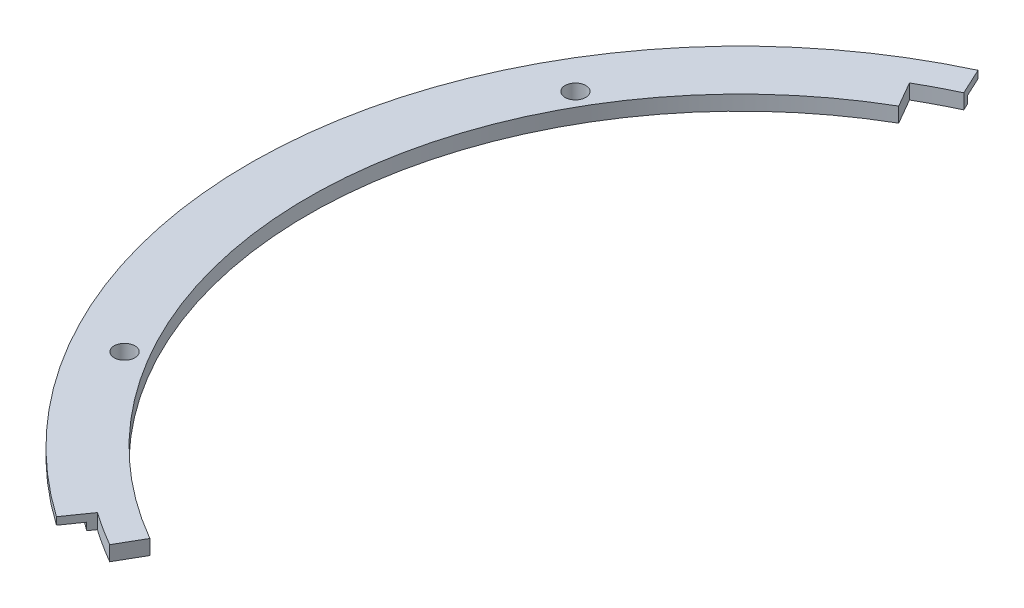
ISO-10303-21;
HEADER;
FILE_DESCRIPTION(('STEP AP214'),'2;1');
FILE_NAME('part.step','',(''),(''),'','','');
FILE_SCHEMA(('AUTOMOTIVE_DESIGN { 1 0 10303 214 1 1 1 1 }'));
ENDSEC;
DATA;
#1=APPLICATION_CONTEXT('core data for automotive mechanical design processes');
#2=APPLICATION_PROTOCOL_DEFINITION('international standard','automotive_design',2000,#1);
#3=PRODUCT_CONTEXT('',#1,'mechanical');
#4=PRODUCT('Part','Part','',(#3));
#5=PRODUCT_RELATED_PRODUCT_CATEGORY('part','',(#4));
#6=PRODUCT_DEFINITION_FORMATION('','',#4);
#7=PRODUCT_DEFINITION_CONTEXT('part definition',#1,'design');
#8=PRODUCT_DEFINITION('design','',#6,#7);
#9=PRODUCT_DEFINITION_SHAPE('','',#8);
#10=(LENGTH_UNIT() NAMED_UNIT(*) SI_UNIT(.MILLI.,.METRE.));
#11=(NAMED_UNIT(*) PLANE_ANGLE_UNIT() SI_UNIT($,.RADIAN.));
#12=(NAMED_UNIT(*) SI_UNIT($,.STERADIAN.) SOLID_ANGLE_UNIT());
#13=UNCERTAINTY_MEASURE_WITH_UNIT(LENGTH_MEASURE(1.E-05),#10,'distance_accuracy_value','');
#14=(GEOMETRIC_REPRESENTATION_CONTEXT(3) GLOBAL_UNCERTAINTY_ASSIGNED_CONTEXT((#13)) GLOBAL_UNIT_ASSIGNED_CONTEXT((#10,
#11,#12)) REPRESENTATION_CONTEXT('',''));
#15=CARTESIAN_POINT('',(0.,0.,0.));
#16=DIRECTION('',(0.,0.,1.));
#17=DIRECTION('',(1.,0.,0.));
#18=AXIS2_PLACEMENT_3D('',#15,#16,#17);
#19=CARTESIAN_POINT('',(0.,5.08,0.));
#20=DIRECTION('',(0.,-1.,0.));
#21=DIRECTION('',(0.,0.,-1.));
#22=AXIS2_PLACEMENT_3D('',#19,#20,#21);
#23=CYLINDRICAL_SURFACE('',#22,160.85);
#24=CARTESIAN_POINT('',(0.,0.,0.));
#25=DIRECTION('',(0.,1.,0.));
#26=DIRECTION('',(0.,0.,1.));
#27=AXIS2_PLACEMENT_3D('',#24,#25,#26);
#28=CIRCLE('',#27,160.85);
#29=CARTESIAN_POINT('',(-67.9781474009922,0.,-145.779607544845));
#30=VERTEX_POINT('',#29);
#31=CARTESIAN_POINT('',(-92.2597697870664,0.,131.760606323884));
#32=VERTEX_POINT('',#31);
#33=EDGE_CURVE('E144',#30,#32,#28,.T.);
#34=ORIENTED_EDGE('',*,*,#33,.T.);
#35=DIRECTION('',(0.,-1.,0.));
#36=VECTOR('',#35,1.);
#37=CARTESIAN_POINT('',(-92.2597697870664,5.08,131.760606323884));
#38=LINE('',#37,#36);
#39=CARTESIAN_POINT('',(-92.2597697870664,2.54,131.760606323884));
#40=VERTEX_POINT('',#39);
#41=EDGE_CURVE('E178',#32,#40,#38,.F.);
#42=ORIENTED_EDGE('',*,*,#41,.T.);
#43=CARTESIAN_POINT('',(0.,2.54,0.));
#44=DIRECTION('',(0.,1.,0.));
#45=DIRECTION('',(0.,0.,1.));
#46=AXIS2_PLACEMENT_3D('',#43,#44,#45);
#47=CIRCLE('',#46,160.85);
#48=CARTESIAN_POINT('',(-67.9781474009922,2.54,-145.779607544845));
#49=VERTEX_POINT('',#48);
#50=EDGE_CURVE('E203',#49,#40,#47,.T.);
#51=ORIENTED_EDGE('',*,*,#50,.F.);
#52=DIRECTION('',(0.,-1.,0.));
#53=VECTOR('',#52,1.);
#54=CARTESIAN_POINT('',(-67.9781474009922,5.08,-145.779607544845));
#55=LINE('',#54,#53);
#56=EDGE_CURVE('E64',#49,#30,#55,.T.);
#57=ORIENTED_EDGE('',*,*,#56,.T.);
#58=EDGE_LOOP('',(#34,#42,#51,#57));
#59=FACE_BOUND('',#58,.T.);
#60=ADVANCED_FACE('F42',(#59),#23,.T.);
#61=CARTESIAN_POINT('',(0.,5.08,0.));
#62=DIRECTION('',(0.,1.,0.));
#63=DIRECTION('',(0.,0.,1.));
#64=AXIS2_PLACEMENT_3D('',#61,#62,#63);
#65=PLANE('',#64);
#66=DIRECTION('',(-0.573576436351049,0.,0.81915204428899));
#67=VECTOR('',#66,1.);
#68=CARTESIAN_POINT('',(-90.7469619361905,5.08,129.600092807072));
#69=LINE('',#68,#67);
#70=CARTESIAN_POINT('',(-90.7469619361905,5.08,129.600092807072));
#71=VERTEX_POINT('',#70);
#72=CARTESIAN_POINT('',(-96.5185748269729,5.08,137.84281025273));
#73=VERTEX_POINT('',#72);
#74=EDGE_CURVE('E145',#71,#73,#69,.T.);
#75=ORIENTED_EDGE('',*,*,#74,.F.);
#76=CARTESIAN_POINT('',(0.,5.08,0.));
#77=DIRECTION('',(0.,-1.,0.));
#78=DIRECTION('',(0.,0.,1.));
#79=AXIS2_PLACEMENT_3D('',#76,#77,#78);
#80=CIRCLE('',#79,158.2125);
#81=CARTESIAN_POINT('',(-79.1062500000006,5.08,137.016044196245));
#82=VERTEX_POINT('',#81);
#83=EDGE_CURVE('E148',#82,#71,#80,.T.);
#84=ORIENTED_EDGE('',*,*,#83,.F.);
#85=DIRECTION('',(-0.500000000000004,0.,0.866025403784436));
#86=VECTOR('',#85,1.);
#87=CARTESIAN_POINT('',(0.,5.08,0.));
#88=LINE('',#87,#86);
#89=CARTESIAN_POINT('',(-74.0750000000006,5.08,128.301663570664));
#90=VERTEX_POINT('',#89);
#91=EDGE_CURVE('E164',#90,#82,#88,.T.);
#92=ORIENTED_EDGE('',*,*,#91,.F.);
#93=CARTESIAN_POINT('',(0.,5.08,0.));
#94=DIRECTION('',(0.,1.,0.));
#95=DIRECTION('',(0.,0.,1.));
#96=AXIS2_PLACEMENT_3D('',#93,#94,#95);
#97=CIRCLE('',#96,148.15);
#98=CARTESIAN_POINT('',(-74.0749999999997,5.08,-128.301663570665));
#99=VERTEX_POINT('',#98);
#100=EDGE_CURVE('E185',#99,#90,#97,.T.);
#101=ORIENTED_EDGE('',*,*,#100,.F.);
#102=DIRECTION('',(0.499999999999998,0.,0.86602540378444));
#103=VECTOR('',#102,1.);
#104=CARTESIAN_POINT('',(-79.1062499999997,5.08,-137.016044196246));
#105=LINE('',#104,#103);
#106=CARTESIAN_POINT('',(-79.1062499999996,5.08,-137.016044196246));
#107=VERTEX_POINT('',#106);
#108=EDGE_CURVE('E162',#107,#99,#105,.T.);
#109=ORIENTED_EDGE('',*,*,#108,.F.);
#110=CARTESIAN_POINT('',(0.,5.08,0.));
#111=DIRECTION('',(0.,1.,0.));
#112=DIRECTION('',(0.,0.,1.));
#113=AXIS2_PLACEMENT_3D('',#110,#111,#112);
#114=CIRCLE('',#113,158.2125);
#115=CARTESIAN_POINT('',(-66.8634917356511,5.08,-143.389220756536));
#116=VERTEX_POINT('',#115);
#117=EDGE_CURVE('E160',#116,#107,#114,.T.);
#118=ORIENTED_EDGE('',*,*,#117,.F.);
#119=DIRECTION('',(0.422618261740704,0.,0.906307787036648));
#120=VECTOR('',#119,1.);
#121=CARTESIAN_POINT('',(-71.1160879944169,5.08,-152.508942863592));
#122=LINE('',#121,#120);
#123=CARTESIAN_POINT('',(-71.1160879944168,5.08,-152.508942863592));
#124=VERTEX_POINT('',#123);
#125=EDGE_CURVE('E123',#124,#116,#122,.T.);
#126=ORIENTED_EDGE('',*,*,#125,.F.);
#127=CARTESIAN_POINT('',(0.,5.08,0.));
#128=DIRECTION('',(0.,1.,0.));
#129=DIRECTION('',(0.,0.,1.));
#130=AXIS2_PLACEMENT_3D('',#127,#128,#129);
#131=CIRCLE('',#130,168.275);
#132=EDGE_CURVE('E181',#124,#73,#131,.T.);
#133=ORIENTED_EDGE('',*,*,#132,.T.);
#134=EDGE_LOOP('',(#75,#84,#92,#101,#109,#118,#126,#133));
#135=FACE_BOUND('',#134,.T.);
#136=CARTESIAN_POINT('',(-133.800924884691,5.08,-77.2499999999923));
#137=DIRECTION('',(0.,1.,0.));
#138=DIRECTION('',(0.,0.,1.));
#139=AXIS2_PLACEMENT_3D('',#136,#137,#138);
#140=CIRCLE('',#139,3.5560000000082);
#141=CARTESIAN_POINT('',(-133.800924884691,5.08,-73.6939999999841));
#142=VERTEX_POINT('',#141);
#143=EDGE_CURVE('E191',#142,#142,#140,.T.);
#144=ORIENTED_EDGE('',*,*,#143,.F.);
#145=EDGE_LOOP('',(#144));
#146=FACE_BOUND('',#145,.T.);
#147=CARTESIAN_POINT('',(-133.800924884683,5.08,77.2500000000076));
#148=DIRECTION('',(0.,1.,0.));
#149=DIRECTION('',(0.,0.,1.));
#150=AXIS2_PLACEMENT_3D('',#147,#148,#149);
#151=CIRCLE('',#150,3.55600000001622);
#152=CARTESIAN_POINT('',(-133.800924884683,5.08,80.8060000000239));
#153=VERTEX_POINT('',#152);
#154=EDGE_CURVE('E197',#153,#153,#151,.T.);
#155=ORIENTED_EDGE('',*,*,#154,.F.);
#156=EDGE_LOOP('',(#155));
#157=FACE_BOUND('',#156,.T.);
#158=ADVANCED_FACE('F225',(#135,#146,#157),#65,.T.);
#159=CARTESIAN_POINT('',(0.,0.,0.));
#160=DIRECTION('',(0.,1.,0.));
#161=DIRECTION('',(0.,0.,1.));
#162=AXIS2_PLACEMENT_3D('',#159,#160,#161);
#163=PLANE('',#162);
#164=CARTESIAN_POINT('',(0.,0.,0.));
#165=DIRECTION('',(0.,-1.,0.));
#166=DIRECTION('',(0.,0.,1.));
#167=AXIS2_PLACEMENT_3D('',#164,#165,#166);
#168=CIRCLE('',#167,158.2125);
#169=CARTESIAN_POINT('',(-79.1062500000006,0.,137.016044196245));
#170=VERTEX_POINT('',#169);
#171=CARTESIAN_POINT('',(-90.7469619361905,0.,129.600092807072));
#172=VERTEX_POINT('',#171);
#173=EDGE_CURVE('E155',#170,#172,#168,.T.);
#174=ORIENTED_EDGE('',*,*,#173,.T.);
#175=DIRECTION('',(-0.573576436351049,0.,0.81915204428899));
#176=VECTOR('',#175,1.);
#177=CARTESIAN_POINT('',(-90.7469619361905,0.,129.600092807072));
#178=LINE('',#177,#176);
#179=EDGE_CURVE('E157',#172,#32,#178,.T.);
#180=ORIENTED_EDGE('',*,*,#179,.T.);
#181=ORIENTED_EDGE('',*,*,#33,.F.);
#182=DIRECTION('',(0.422618261740704,0.,0.906307787036648));
#183=VECTOR('',#182,1.);
#184=CARTESIAN_POINT('',(-71.1160879944169,0.,-152.508942863592));
#185=LINE('',#184,#183);
#186=CARTESIAN_POINT('',(-66.8634917356511,0.,-143.389220756536));
#187=VERTEX_POINT('',#186);
#188=EDGE_CURVE('E121',#30,#187,#185,.T.);
#189=ORIENTED_EDGE('',*,*,#188,.T.);
#190=CARTESIAN_POINT('',(0.,0.,0.));
#191=DIRECTION('',(0.,1.,0.));
#192=DIRECTION('',(0.,0.,1.));
#193=AXIS2_PLACEMENT_3D('',#190,#191,#192);
#194=CIRCLE('',#193,158.2125);
#195=CARTESIAN_POINT('',(-79.1062499999996,0.,-137.016044196246));
#196=VERTEX_POINT('',#195);
#197=EDGE_CURVE('E131',#187,#196,#194,.T.);
#198=ORIENTED_EDGE('',*,*,#197,.T.);
#199=DIRECTION('',(0.499999999999998,0.,0.86602540378444));
#200=VECTOR('',#199,1.);
#201=CARTESIAN_POINT('',(-79.1062499999997,0.,-137.016044196246));
#202=LINE('',#201,#200);
#203=CARTESIAN_POINT('',(-74.0749999999997,0.,-128.301663570665));
#204=VERTEX_POINT('',#203);
#205=EDGE_CURVE('E136',#196,#204,#202,.T.);
#206=ORIENTED_EDGE('',*,*,#205,.T.);
#207=CARTESIAN_POINT('',(0.,0.,0.));
#208=DIRECTION('',(0.,1.,0.));
#209=DIRECTION('',(0.,0.,1.));
#210=AXIS2_PLACEMENT_3D('',#207,#208,#209);
#211=CIRCLE('',#210,148.15);
#212=CARTESIAN_POINT('',(-74.0750000000006,0.,128.301663570664));
#213=VERTEX_POINT('',#212);
#214=EDGE_CURVE('E183',#204,#213,#211,.T.);
#215=ORIENTED_EDGE('',*,*,#214,.T.);
#216=DIRECTION('',(-0.500000000000004,0.,0.866025403784436));
#217=VECTOR('',#216,1.);
#218=CARTESIAN_POINT('',(0.,0.,0.));
#219=LINE('',#218,#217);
#220=EDGE_CURVE('E152',#213,#170,#219,.T.);
#221=ORIENTED_EDGE('',*,*,#220,.T.);
#222=EDGE_LOOP('',(#174,#180,#181,#189,#198,#206,#215,#221));
#223=FACE_BOUND('',#222,.T.);
#224=CARTESIAN_POINT('',(-133.800924884683,0.,77.2500000000076));
#225=DIRECTION('',(0.,1.,0.));
#226=DIRECTION('',(0.,0.,1.));
#227=AXIS2_PLACEMENT_3D('',#224,#225,#226);
#228=CIRCLE('',#227,3.55600000001622);
#229=CARTESIAN_POINT('',(-133.800924884683,0.,80.8060000000239));
#230=VERTEX_POINT('',#229);
#231=EDGE_CURVE('E194',#230,#230,#228,.T.);
#232=ORIENTED_EDGE('',*,*,#231,.T.);
#233=EDGE_LOOP('',(#232));
#234=FACE_BOUND('',#233,.T.);
#235=CARTESIAN_POINT('',(-133.800924884691,0.,-77.2499999999923));
#236=DIRECTION('',(0.,1.,0.));
#237=DIRECTION('',(0.,0.,1.));
#238=AXIS2_PLACEMENT_3D('',#235,#236,#237);
#239=CIRCLE('',#238,3.5560000000082);
#240=CARTESIAN_POINT('',(-133.800924884691,0.,-73.6939999999841));
#241=VERTEX_POINT('',#240);
#242=EDGE_CURVE('E188',#241,#241,#239,.T.);
#243=ORIENTED_EDGE('',*,*,#242,.T.);
#244=EDGE_LOOP('',(#243));
#245=FACE_BOUND('',#244,.T.);
#246=ADVANCED_FACE('F140',(#223,#234,#245),#163,.F.);
#247=CARTESIAN_POINT('',(-133.800924884683,5.08,77.2500000000076));
#248=DIRECTION('',(0.,-1.,0.));
#249=DIRECTION('',(0.,0.,-1.));
#250=AXIS2_PLACEMENT_3D('',#247,#248,#249);
#251=CYLINDRICAL_SURFACE('',#250,3.55600000001622);
#252=ORIENTED_EDGE('',*,*,#154,.T.);
#253=EDGE_LOOP('',(#252));
#254=FACE_BOUND('',#253,.T.);
#255=ORIENTED_EDGE('',*,*,#231,.F.);
#256=EDGE_LOOP('',(#255));
#257=FACE_BOUND('',#256,.T.);
#258=ADVANCED_FACE('F255',(#254,#257),#251,.F.);
#259=CARTESIAN_POINT('',(-133.800924884691,5.08,-77.2499999999923));
#260=DIRECTION('',(0.,-1.,0.));
#261=DIRECTION('',(0.,0.,-1.));
#262=AXIS2_PLACEMENT_3D('',#259,#260,#261);
#263=CYLINDRICAL_SURFACE('',#262,3.5560000000082);
#264=ORIENTED_EDGE('',*,*,#143,.T.);
#265=EDGE_LOOP('',(#264));
#266=FACE_BOUND('',#265,.T.);
#267=ORIENTED_EDGE('',*,*,#242,.F.);
#268=EDGE_LOOP('',(#267));
#269=FACE_BOUND('',#268,.T.);
#270=ADVANCED_FACE('F259',(#266,#269),#263,.F.);
#271=CARTESIAN_POINT('',(0.,5.08,0.));
#272=DIRECTION('',(0.,-1.,0.));
#273=DIRECTION('',(0.,0.,-1.));
#274=AXIS2_PLACEMENT_3D('',#271,#272,#273);
#275=CYLINDRICAL_SURFACE('',#274,148.15);
#276=DIRECTION('',(0.,-1.,0.));
#277=VECTOR('',#276,1.);
#278=CARTESIAN_POINT('',(-74.0750000000006,5.08,128.301663570664));
#279=LINE('',#278,#277);
#280=EDGE_CURVE('E11',#213,#90,#279,.F.);
#281=ORIENTED_EDGE('',*,*,#280,.F.);
#282=ORIENTED_EDGE('',*,*,#214,.F.);
#283=DIRECTION('',(0.,-1.,0.));
#284=VECTOR('',#283,1.);
#285=CARTESIAN_POINT('',(-74.0749999999997,5.08,-128.301663570665));
#286=LINE('',#285,#284);
#287=EDGE_CURVE('E49',#99,#204,#286,.T.);
#288=ORIENTED_EDGE('',*,*,#287,.F.);
#289=ORIENTED_EDGE('',*,*,#100,.T.);
#290=EDGE_LOOP('',(#281,#282,#288,#289));
#291=FACE_BOUND('',#290,.T.);
#292=ADVANCED_FACE('F218',(#291),#275,.F.);
#293=CARTESIAN_POINT('',(0.,2.54,0.));
#294=DIRECTION('',(0.,1.,0.));
#295=DIRECTION('',(0.,0.,1.));
#296=AXIS2_PLACEMENT_3D('',#293,#294,#295);
#297=CYLINDRICAL_SURFACE('',#296,168.275);
#298=DIRECTION('',(0.,1.,0.));
#299=VECTOR('',#298,1.);
#300=CARTESIAN_POINT('',(-71.1160879944168,0.,-152.508942863592));
#301=LINE('',#300,#299);
#302=CARTESIAN_POINT('',(-71.1160879944168,2.54,-152.508942863592));
#303=VERTEX_POINT('',#302);
#304=EDGE_CURVE('E128',#303,#124,#301,.T.);
#305=ORIENTED_EDGE('',*,*,#304,.F.);
#306=CARTESIAN_POINT('',(0.,2.54,0.));
#307=DIRECTION('',(0.,1.,0.));
#308=DIRECTION('',(0.,0.,1.));
#309=AXIS2_PLACEMENT_3D('',#306,#307,#308);
#310=CIRCLE('',#309,168.275);
#311=CARTESIAN_POINT('',(-96.518574826973,2.54,137.84281025273));
#312=VERTEX_POINT('',#311);
#313=EDGE_CURVE('E56',#303,#312,#310,.T.);
#314=ORIENTED_EDGE('',*,*,#313,.T.);
#315=DIRECTION('',(0.,1.,0.));
#316=VECTOR('',#315,1.);
#317=CARTESIAN_POINT('',(-96.5185748269729,0.,137.84281025273));
#318=LINE('',#317,#316);
#319=EDGE_CURVE('E168',#312,#73,#318,.T.);
#320=ORIENTED_EDGE('',*,*,#319,.T.);
#321=ORIENTED_EDGE('',*,*,#132,.F.);
#322=EDGE_LOOP('',(#305,#314,#320,#321));
#323=FACE_BOUND('',#322,.T.);
#324=ADVANCED_FACE('F237',(#323),#297,.T.);
#325=CARTESIAN_POINT('',(0.,2.54,0.));
#326=DIRECTION('',(0.,1.,0.));
#327=DIRECTION('',(0.,0.,1.));
#328=AXIS2_PLACEMENT_3D('',#325,#326,#327);
#329=PLANE('',#328);
#330=ORIENTED_EDGE('',*,*,#50,.T.);
#331=DIRECTION('',(-0.573576436351049,0.,0.81915204428899));
#332=VECTOR('',#331,1.);
#333=CARTESIAN_POINT('',(-2.50096401565561E-13,2.54,-1.75119385655329E-13));
#334=LINE('',#333,#332);
#335=EDGE_CURVE('E208',#40,#312,#334,.T.);
#336=ORIENTED_EDGE('',*,*,#335,.T.);
#337=ORIENTED_EDGE('',*,*,#313,.F.);
#338=DIRECTION('',(0.422618261740704,0.,0.906307787036648));
#339=VECTOR('',#338,1.);
#340=CARTESIAN_POINT('',(1.00620377256516E-13,2.54,0.));
#341=LINE('',#340,#339);
#342=EDGE_CURVE('E206',#303,#49,#341,.T.);
#343=ORIENTED_EDGE('',*,*,#342,.T.);
#344=EDGE_LOOP('',(#330,#336,#337,#343));
#345=FACE_BOUND('',#344,.T.);
#346=ADVANCED_FACE('F235',(#345),#329,.F.);
#347=CARTESIAN_POINT('',(-79.1062499999997,0.,-137.016044196246));
#348=DIRECTION('',(-0.86602540378444,0.,0.499999999999998));
#349=DIRECTION('',(0.499999999999998,0.,0.86602540378444));
#350=AXIS2_PLACEMENT_3D('',#347,#348,#349);
#351=PLANE('',#350);
#352=ORIENTED_EDGE('',*,*,#287,.T.);
#353=ORIENTED_EDGE('',*,*,#205,.F.);
#354=DIRECTION('',(0.,1.,0.));
#355=VECTOR('',#354,1.);
#356=CARTESIAN_POINT('',(-79.1062499999996,0.,-137.016044196246));
#357=LINE('',#356,#355);
#358=EDGE_CURVE('E127',#196,#107,#357,.T.);
#359=ORIENTED_EDGE('',*,*,#358,.T.);
#360=ORIENTED_EDGE('',*,*,#108,.T.);
#361=EDGE_LOOP('',(#352,#353,#359,#360));
#362=FACE_BOUND('',#361,.T.);
#363=ADVANCED_FACE('F212',(#362),#351,.F.);
#364=CARTESIAN_POINT('',(-71.1160879944169,0.,-152.508942863592));
#365=DIRECTION('',(-0.906307787036648,0.,0.422618261740704));
#366=DIRECTION('',(0.422618261740704,0.,0.906307787036648));
#367=AXIS2_PLACEMENT_3D('',#364,#365,#366);
#368=PLANE('',#367);
#369=ORIENTED_EDGE('',*,*,#342,.F.);
#370=ORIENTED_EDGE('',*,*,#304,.T.);
#371=ORIENTED_EDGE('',*,*,#125,.T.);
#372=DIRECTION('',(0.,1.,0.));
#373=VECTOR('',#372,1.);
#374=CARTESIAN_POINT('',(-66.8634917356511,0.,-143.389220756536));
#375=LINE('',#374,#373);
#376=EDGE_CURVE('E117',#187,#116,#375,.T.);
#377=ORIENTED_EDGE('',*,*,#376,.F.);
#378=ORIENTED_EDGE('',*,*,#188,.F.);
#379=ORIENTED_EDGE('',*,*,#56,.F.);
#380=EDGE_LOOP('',(#369,#370,#371,#377,#378,#379));
#381=FACE_BOUND('',#380,.T.);
#382=ADVANCED_FACE('F119',(#381),#368,.F.);
#383=CARTESIAN_POINT('',(0.,0.,0.));
#384=DIRECTION('',(0.,1.,0.));
#385=DIRECTION('',(0.,0.,1.));
#386=AXIS2_PLACEMENT_3D('',#383,#384,#385);
#387=CYLINDRICAL_SURFACE('',#386,158.2125);
#388=ORIENTED_EDGE('',*,*,#117,.T.);
#389=ORIENTED_EDGE('',*,*,#358,.F.);
#390=ORIENTED_EDGE('',*,*,#197,.F.);
#391=ORIENTED_EDGE('',*,*,#376,.T.);
#392=EDGE_LOOP('',(#388,#389,#390,#391));
#393=FACE_BOUND('',#392,.T.);
#394=ADVANCED_FACE('F132',(#393),#387,.F.);
#395=CARTESIAN_POINT('',(-90.7469619361905,0.,129.600092807072));
#396=DIRECTION('',(-0.81915204428899,0.,-0.573576436351048));
#397=DIRECTION('',(-0.573576436351049,0.,0.81915204428899));
#398=AXIS2_PLACEMENT_3D('',#395,#396,#397);
#399=PLANE('',#398);
#400=ORIENTED_EDGE('',*,*,#179,.F.);
#401=DIRECTION('',(0.,1.,0.));
#402=VECTOR('',#401,1.);
#403=CARTESIAN_POINT('',(-90.7469619361905,0.,129.600092807072));
#404=LINE('',#403,#402);
#405=EDGE_CURVE('E170',#172,#71,#404,.T.);
#406=ORIENTED_EDGE('',*,*,#405,.T.);
#407=ORIENTED_EDGE('',*,*,#74,.T.);
#408=ORIENTED_EDGE('',*,*,#319,.F.);
#409=ORIENTED_EDGE('',*,*,#335,.F.);
#410=ORIENTED_EDGE('',*,*,#41,.F.);
#411=EDGE_LOOP('',(#400,#406,#407,#408,#409,#410));
#412=FACE_BOUND('',#411,.T.);
#413=ADVANCED_FACE('F238',(#412),#399,.F.);
#414=CARTESIAN_POINT('',(0.,0.,0.));
#415=DIRECTION('',(0.,1.,0.));
#416=DIRECTION('',(0.,0.,1.));
#417=AXIS2_PLACEMENT_3D('',#414,#415,#416);
#418=CYLINDRICAL_SURFACE('',#417,158.2125);
#419=ORIENTED_EDGE('',*,*,#83,.T.);
#420=ORIENTED_EDGE('',*,*,#405,.F.);
#421=ORIENTED_EDGE('',*,*,#173,.F.);
#422=DIRECTION('',(0.,1.,0.));
#423=VECTOR('',#422,1.);
#424=CARTESIAN_POINT('',(-79.1062500000006,0.,137.016044196245));
#425=LINE('',#424,#423);
#426=EDGE_CURVE('E172',#170,#82,#425,.T.);
#427=ORIENTED_EDGE('',*,*,#426,.T.);
#428=EDGE_LOOP('',(#419,#420,#421,#427));
#429=FACE_BOUND('',#428,.T.);
#430=ADVANCED_FACE('F228',(#429),#418,.T.);
#431=CARTESIAN_POINT('',(0.,0.,0.));
#432=DIRECTION('',(-0.866025403784436,0.,-0.500000000000004));
#433=DIRECTION('',(-0.500000000000004,0.,0.866025403784436));
#434=AXIS2_PLACEMENT_3D('',#431,#432,#433);
#435=PLANE('',#434);
#436=ORIENTED_EDGE('',*,*,#280,.T.);
#437=ORIENTED_EDGE('',*,*,#91,.T.);
#438=ORIENTED_EDGE('',*,*,#426,.F.);
#439=ORIENTED_EDGE('',*,*,#220,.F.);
#440=EDGE_LOOP('',(#436,#437,#438,#439));
#441=FACE_BOUND('',#440,.T.);
#442=ADVANCED_FACE('F221',(#441),#435,.F.);
#443=CLOSED_SHELL('',(#60,#158,#246,#258,#270,#292,#324,#346,#363,#382,#394,#413,#430,#442));
#444=MANIFOLD_SOLID_BREP('B2',#443);
#445=ADVANCED_BREP_SHAPE_REPRESENTATION('',(#18,#444),#14);
#446=SHAPE_DEFINITION_REPRESENTATION(#9,#445);
ENDSEC;
END-ISO-10303-21;
